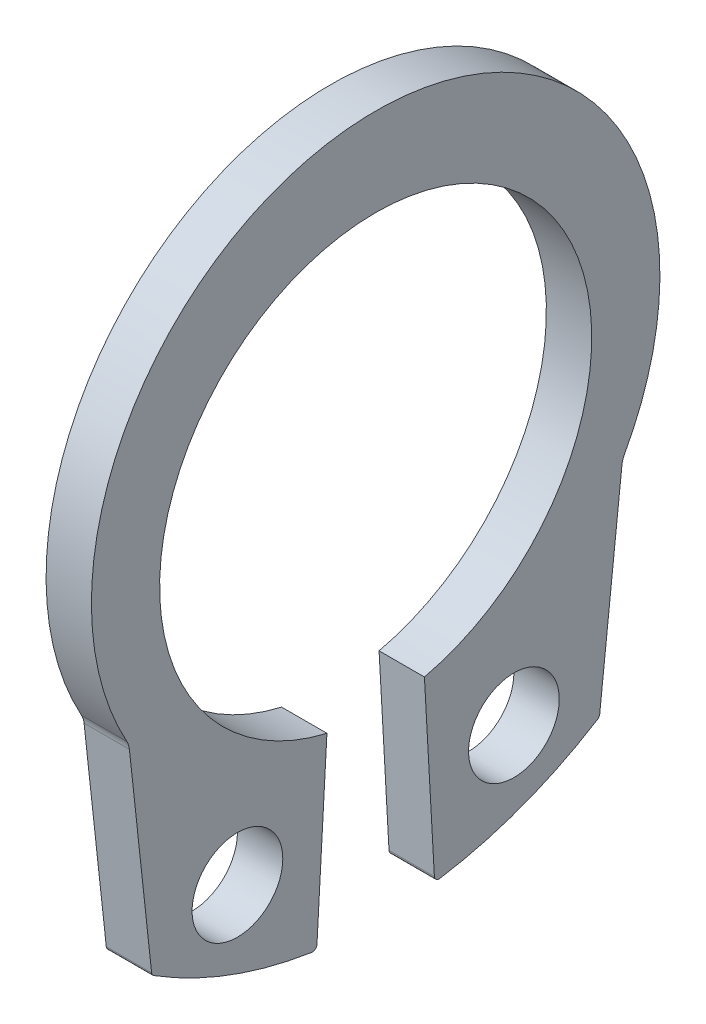
ISO-10303-21;
HEADER;
FILE_DESCRIPTION(('STEP AP214'),'2;1');
FILE_NAME('part.step','',(''),(''),'','','');
FILE_SCHEMA(('AUTOMOTIVE_DESIGN { 1 0 10303 214 1 1 1 1 }'));
ENDSEC;
DATA;
#1=APPLICATION_CONTEXT('core data for automotive mechanical design processes');
#2=APPLICATION_PROTOCOL_DEFINITION('international standard','automotive_design',2000,#1);
#3=PRODUCT_CONTEXT('',#1,'mechanical');
#4=PRODUCT('Part','Part','',(#3));
#5=PRODUCT_RELATED_PRODUCT_CATEGORY('part','',(#4));
#6=PRODUCT_DEFINITION_FORMATION('','',#4);
#7=PRODUCT_DEFINITION_CONTEXT('part definition',#1,'design');
#8=PRODUCT_DEFINITION('design','',#6,#7);
#9=PRODUCT_DEFINITION_SHAPE('','',#8);
#10=(LENGTH_UNIT() NAMED_UNIT(*) SI_UNIT(.MILLI.,.METRE.));
#11=(NAMED_UNIT(*) PLANE_ANGLE_UNIT() SI_UNIT($,.RADIAN.));
#12=(NAMED_UNIT(*) SI_UNIT($,.STERADIAN.) SOLID_ANGLE_UNIT());
#13=UNCERTAINTY_MEASURE_WITH_UNIT(LENGTH_MEASURE(1.E-05),#10,'distance_accuracy_value','');
#14=(GEOMETRIC_REPRESENTATION_CONTEXT(3) GLOBAL_UNCERTAINTY_ASSIGNED_CONTEXT((#13)) GLOBAL_UNIT_ASSIGNED_CONTEXT((#10,
#11,#12)) REPRESENTATION_CONTEXT('',''));
#15=CARTESIAN_POINT('',(0.,0.,0.));
#16=DIRECTION('',(0.,0.,1.));
#17=DIRECTION('',(1.,0.,0.));
#18=AXIS2_PLACEMENT_3D('',#15,#16,#17);
#19=CARTESIAN_POINT('',(0.85,-2.39792397685185,-5.01373537734668));
#20=DIRECTION('',(-1.,0.,0.));
#21=DIRECTION('',(0.,0.,1.));
#22=AXIS2_PLACEMENT_3D('',#19,#20,#21);
#23=CYLINDRICAL_SURFACE('',#22,0.4);
#24=CARTESIAN_POINT('',(0.85,-2.39792397685185,-5.01373537734668));
#25=DIRECTION('',(-1.,0.,0.));
#26=DIRECTION('',(0.,0.,-1.));
#27=AXIS2_PLACEMENT_3D('',#24,#25,#26);
#28=CIRCLE('',#27,0.4);
#29=CARTESIAN_POINT('',(0.85,-2.3547374993622,-4.61607355096397));
#30=VERTEX_POINT('',#29);
#31=CARTESIAN_POINT('',(0.85,-2.20449375873755,-4.6636143258227));
#32=VERTEX_POINT('',#31);
#33=EDGE_CURVE('E37',#30,#32,#28,.T.);
#34=ORIENTED_EDGE('',*,*,#33,.F.);
#35=DIRECTION('',(1.,0.,0.));
#36=VECTOR('',#35,1.);
#37=CARTESIAN_POINT('',(0.85,-2.3547374993622,-4.61607355096397));
#38=LINE('',#37,#36);
#39=CARTESIAN_POINT('',(0.,-2.3547374993622,-4.61607355096397));
#40=VERTEX_POINT('',#39);
#41=EDGE_CURVE('E212',#40,#30,#38,.T.);
#42=ORIENTED_EDGE('',*,*,#41,.F.);
#43=CARTESIAN_POINT('',(0.,-2.39792397685185,-5.01373537734668));
#44=DIRECTION('',(1.,0.,0.));
#45=DIRECTION('',(0.,0.,-1.));
#46=AXIS2_PLACEMENT_3D('',#43,#44,#45);
#47=CIRCLE('',#46,0.4);
#48=CARTESIAN_POINT('',(0.,-2.20449375873755,-4.6636143258227));
#49=VERTEX_POINT('',#48);
#50=EDGE_CURVE('E11',#49,#40,#47,.T.);
#51=ORIENTED_EDGE('',*,*,#50,.F.);
#52=DIRECTION('',(-1.,0.,0.));
#53=VECTOR('',#52,1.);
#54=CARTESIAN_POINT('',(0.85,-2.20449375873755,-4.6636143258227));
#55=LINE('',#54,#53);
#56=EDGE_CURVE('E309',#32,#49,#55,.T.);
#57=ORIENTED_EDGE('',*,*,#56,.F.);
#58=EDGE_LOOP('',(#34,#42,#51,#57));
#59=FACE_BOUND('',#58,.T.);
#60=ADVANCED_FACE('F17',(#59),#23,.F.);
#61=CARTESIAN_POINT('',(0.85,-2.39792397685184,5.01373537734669));
#62=DIRECTION('',(-1.,0.,0.));
#63=DIRECTION('',(0.,0.,1.));
#64=AXIS2_PLACEMENT_3D('',#61,#62,#63);
#65=CYLINDRICAL_SURFACE('',#64,0.4);
#66=CARTESIAN_POINT('',(0.85,-2.39792397685184,5.01373537734669));
#67=DIRECTION('',(-1.,0.,0.));
#68=DIRECTION('',(0.,0.,-1.));
#69=AXIS2_PLACEMENT_3D('',#66,#67,#68);
#70=CIRCLE('',#69,0.4);
#71=CARTESIAN_POINT('',(0.85,-2.20449375873754,4.66361432582271));
#72=VERTEX_POINT('',#71);
#73=CARTESIAN_POINT('',(0.85,-2.35473749936219,4.61607355096397));
#74=VERTEX_POINT('',#73);
#75=EDGE_CURVE('E220',#72,#74,#70,.T.);
#76=ORIENTED_EDGE('',*,*,#75,.F.);
#77=DIRECTION('',(1.,0.,0.));
#78=VECTOR('',#77,1.);
#79=CARTESIAN_POINT('',(0.85,-2.20449375873754,4.66361432582271));
#80=LINE('',#79,#78);
#81=CARTESIAN_POINT('',(0.,-2.20449375873754,4.66361432582271));
#82=VERTEX_POINT('',#81);
#83=EDGE_CURVE('E299',#82,#72,#80,.T.);
#84=ORIENTED_EDGE('',*,*,#83,.F.);
#85=CARTESIAN_POINT('',(0.,-2.39792397685184,5.01373537734669));
#86=DIRECTION('',(1.,0.,0.));
#87=DIRECTION('',(0.,0.,-1.));
#88=AXIS2_PLACEMENT_3D('',#85,#86,#87);
#89=CIRCLE('',#88,0.4);
#90=CARTESIAN_POINT('',(0.,-2.35473749936219,4.61607355096397));
#91=VERTEX_POINT('',#90);
#92=EDGE_CURVE('E25',#91,#82,#89,.T.);
#93=ORIENTED_EDGE('',*,*,#92,.F.);
#94=DIRECTION('',(-1.,0.,0.));
#95=VECTOR('',#94,1.);
#96=CARTESIAN_POINT('',(0.85,-2.35473749936219,4.61607355096397));
#97=LINE('',#96,#95);
#98=EDGE_CURVE('E236',#74,#91,#97,.T.);
#99=ORIENTED_EDGE('',*,*,#98,.F.);
#100=EDGE_LOOP('',(#76,#84,#93,#99));
#101=FACE_BOUND('',#100,.T.);
#102=ADVANCED_FACE('F366',(#101),#65,.F.);
#103=CARTESIAN_POINT('',(0.,0.,0.));
#104=DIRECTION('',(1.,0.,0.));
#105=DIRECTION('',(0.,1.,0.));
#106=AXIS2_PLACEMENT_3D('',#103,#104,#105);
#107=PLANE('',#106);
#108=CARTESIAN_POINT('',(0.,-5.56782224250959,2.59106511830008));
#109=DIRECTION('',(1.,0.,0.));
#110=DIRECTION('',(0.,0.,-1.));
#111=AXIS2_PLACEMENT_3D('',#108,#109,#110);
#112=CIRCLE('',#111,0.85);
#113=CARTESIAN_POINT('',(0.,-5.56782224250959,1.74106511830008));
#114=VERTEX_POINT('',#113);
#115=EDGE_CURVE('E317',#114,#114,#112,.T.);
#116=ORIENTED_EDGE('',*,*,#115,.T.);
#117=EDGE_LOOP('',(#116));
#118=FACE_BOUND('',#117,.T.);
#119=CARTESIAN_POINT('',(0.,-5.56782224250959,-2.59106511830008));
#120=DIRECTION('',(-1.,0.,0.));
#121=DIRECTION('',(0.,0.,-1.));
#122=AXIS2_PLACEMENT_3D('',#119,#120,#121);
#123=CIRCLE('',#122,0.85);
#124=CARTESIAN_POINT('',(0.,-5.56782224250959,-3.44106511830008));
#125=VERTEX_POINT('',#124);
#126=EDGE_CURVE('E333',#125,#125,#123,.T.);
#127=ORIENTED_EDGE('',*,*,#126,.F.);
#128=EDGE_LOOP('',(#127));
#129=FACE_BOUND('',#128,.T.);
#130=DIRECTION('',(0.,0.994154565956785,0.107966193724127));
#131=VECTOR('',#130,1.);
#132=CARTESIAN_POINT('',(0.,-0.522915110689556,4.81501131945199));
#133=LINE('',#132,#131);
#134=CARTESIAN_POINT('',(0.,-6.19075573329271,4.19947808185275));
#135=VERTEX_POINT('',#134);
#136=EDGE_CURVE('E240',#135,#91,#133,.T.);
#137=ORIENTED_EDGE('',*,*,#136,.T.);
#138=ORIENTED_EDGE('',*,*,#92,.T.);
#139=CARTESIAN_POINT('',(0.,0.371997807017542,0.));
#140=DIRECTION('',(1.,0.,0.));
#141=DIRECTION('',(0.,0.,-1.));
#142=AXIS2_PLACEMENT_3D('',#139,#140,#141);
#143=CIRCLE('',#142,5.32800219298246);
#144=EDGE_CURVE('E304',#49,#82,#143,.T.);
#145=ORIENTED_EDGE('',*,*,#144,.F.);
#146=ORIENTED_EDGE('',*,*,#50,.T.);
#147=DIRECTION('',(0.,0.994154565956785,-0.107966193724126));
#148=VECTOR('',#147,1.);
#149=CARTESIAN_POINT('',(0.,-0.522915110689551,-4.81501131945199));
#150=LINE('',#149,#148);
#151=CARTESIAN_POINT('',(0.,-6.19075573329271,-4.19947808185275));
#152=VERTEX_POINT('',#151);
#153=EDGE_CURVE('E208',#152,#40,#150,.T.);
#154=ORIENTED_EDGE('',*,*,#153,.F.);
#155=CARTESIAN_POINT('',(0.,-6.1811158134206,-4.11071353412026));
#156=DIRECTION('',(-1.,0.,0.));
#157=DIRECTION('',(0.,0.,-1.));
#158=AXIS2_PLACEMENT_3D('',#155,#156,#157);
#159=CIRCLE('',#158,0.0892864658797376);
#160=CARTESIAN_POINT('',(0.,-6.25675257958271,-4.15815984687302));
#161=VERTEX_POINT('',#160);
#162=EDGE_CURVE('E200',#152,#161,#159,.T.);
#163=ORIENTED_EDGE('',*,*,#162,.T.);
#164=CARTESIAN_POINT('',(0.,0.371997807017542,0.));
#165=DIRECTION('',(1.,0.,0.));
#166=DIRECTION('',(0.,0.,-1.));
#167=AXIS2_PLACEMENT_3D('',#164,#165,#166);
#168=CIRCLE('',#167,7.825);
#169=CARTESIAN_POINT('',(0.,-7.35997373313335,-1.20301334252644));
#170=VERTEX_POINT('',#169);
#171=EDGE_CURVE('E157',#170,#161,#168,.T.);
#172=ORIENTED_EDGE('',*,*,#171,.F.);
#173=CARTESIAN_POINT('',(0.,-7.27174876021286,-1.18928646587975));
#174=DIRECTION('',(-1.,0.,0.));
#175=DIRECTION('',(0.,0.,-1.));
#176=AXIS2_PLACEMENT_3D('',#173,#174,#175);
#177=CIRCLE('',#176,0.0892864658797398);
#178=CARTESIAN_POINT('',(0.,-7.27674135002132,-1.1001396934407));
#179=VERTEX_POINT('',#178);
#180=EDGE_CURVE('E148',#170,#179,#177,.T.);
#181=ORIENTED_EDGE('',*,*,#180,.T.);
#182=DIRECTION('',(0.,0.998435446634371,0.0559165351575345));
#183=VECTOR('',#182,1.);
#184=CARTESIAN_POINT('',(0.,0.0386678666475541,-0.690446369716576));
#185=LINE('',#184,#183);
#186=CARTESIAN_POINT('',(0.,-3.94561359779142,-0.913582692985955));
#187=VERTEX_POINT('',#186);
#188=EDGE_CURVE('E154',#179,#187,#185,.T.);
#189=ORIENTED_EDGE('',*,*,#188,.T.);
#190=CARTESIAN_POINT('',(0.,0.,0.));
#191=DIRECTION('',(1.,0.,0.));
#192=DIRECTION('',(0.,0.,-1.));
#193=AXIS2_PLACEMENT_3D('',#190,#191,#192);
#194=CIRCLE('',#193,4.05);
#195=CARTESIAN_POINT('',(0.,-3.94561359779142,0.913582692985955));
#196=VERTEX_POINT('',#195);
#197=EDGE_CURVE('E248',#187,#196,#194,.T.);
#198=ORIENTED_EDGE('',*,*,#197,.T.);
#199=DIRECTION('',(0.,0.998435446634371,-0.0559165351575343));
#200=VECTOR('',#199,1.);
#201=CARTESIAN_POINT('',(0.,0.0386678666475539,0.690446369716574));
#202=LINE('',#201,#200);
#203=CARTESIAN_POINT('',(0.,-7.27674135002132,1.1001396934407));
#204=VERTEX_POINT('',#203);
#205=EDGE_CURVE('E185',#204,#196,#202,.T.);
#206=ORIENTED_EDGE('',*,*,#205,.F.);
#207=CARTESIAN_POINT('',(0.,-7.27174876021286,1.18928646587974));
#208=DIRECTION('',(1.,0.,0.));
#209=DIRECTION('',(0.,0.,-1.));
#210=AXIS2_PLACEMENT_3D('',#207,#208,#209);
#211=CIRCLE('',#210,0.0892864658797448);
#212=CARTESIAN_POINT('',(0.,-7.35997373313335,1.20301334252644));
#213=VERTEX_POINT('',#212);
#214=EDGE_CURVE('E274',#213,#204,#211,.T.);
#215=ORIENTED_EDGE('',*,*,#214,.F.);
#216=CARTESIAN_POINT('',(0.,0.371997807017542,0.));
#217=DIRECTION('',(1.,0.,0.));
#218=DIRECTION('',(0.,0.,-1.));
#219=AXIS2_PLACEMENT_3D('',#216,#217,#218);
#220=CIRCLE('',#219,7.825);
#221=CARTESIAN_POINT('',(0.,-6.25675257958271,4.15815984687302));
#222=VERTEX_POINT('',#221);
#223=EDGE_CURVE('E265',#222,#213,#220,.T.);
#224=ORIENTED_EDGE('',*,*,#223,.F.);
#225=CARTESIAN_POINT('',(0.,-6.1811158134206,4.11071353412026));
#226=DIRECTION('',(1.,0.,0.));
#227=DIRECTION('',(0.,0.,-1.));
#228=AXIS2_PLACEMENT_3D('',#225,#226,#227);
#229=CIRCLE('',#228,0.0892864658797463);
#230=EDGE_CURVE('E253',#135,#222,#229,.T.);
#231=ORIENTED_EDGE('',*,*,#230,.F.);
#232=EDGE_LOOP('',(#137,#138,#145,#146,#154,#163,#172,#181,#189,#198,#206,#215,#224,#231));
#233=FACE_BOUND('',#232,.T.);
#234=ADVANCED_FACE('F151',(#118,#129,#233),#107,.F.);
#235=CARTESIAN_POINT('',(0.85,0.,0.));
#236=DIRECTION('',(1.,0.,0.));
#237=DIRECTION('',(0.,1.,0.));
#238=AXIS2_PLACEMENT_3D('',#235,#236,#237);
#239=PLANE('',#238);
#240=CARTESIAN_POINT('',(0.85,-5.56782224250959,2.59106511830008));
#241=DIRECTION('',(1.,0.,0.));
#242=DIRECTION('',(0.,0.,-1.));
#243=AXIS2_PLACEMENT_3D('',#240,#241,#242);
#244=CIRCLE('',#243,0.85);
#245=CARTESIAN_POINT('',(0.85,-5.56782224250959,1.74106511830008));
#246=VERTEX_POINT('',#245);
#247=EDGE_CURVE('E329',#246,#246,#244,.T.);
#248=ORIENTED_EDGE('',*,*,#247,.F.);
#249=EDGE_LOOP('',(#248));
#250=FACE_BOUND('',#249,.T.);
#251=CARTESIAN_POINT('',(0.85,-5.56782224250959,-2.59106511830008));
#252=DIRECTION('',(-1.,0.,0.));
#253=DIRECTION('',(0.,0.,-1.));
#254=AXIS2_PLACEMENT_3D('',#251,#252,#253);
#255=CIRCLE('',#254,0.85);
#256=CARTESIAN_POINT('',(0.85,-5.56782224250959,-3.44106511830008));
#257=VERTEX_POINT('',#256);
#258=EDGE_CURVE('E340',#257,#257,#255,.T.);
#259=ORIENTED_EDGE('',*,*,#258,.T.);
#260=EDGE_LOOP('',(#259));
#261=FACE_BOUND('',#260,.T.);
#262=DIRECTION('',(0.,0.994154565956785,0.107966193724127));
#263=VECTOR('',#262,1.);
#264=CARTESIAN_POINT('',(0.85,-0.522915110689556,4.81501131945199));
#265=LINE('',#264,#263);
#266=CARTESIAN_POINT('',(0.85,-6.19075573329271,4.19947808185275));
#267=VERTEX_POINT('',#266);
#268=EDGE_CURVE('E241',#267,#74,#265,.T.);
#269=ORIENTED_EDGE('',*,*,#268,.F.);
#270=CARTESIAN_POINT('',(0.85,-6.1811158134206,4.11071353412026));
#271=DIRECTION('',(1.,0.,0.));
#272=DIRECTION('',(0.,0.,-1.));
#273=AXIS2_PLACEMENT_3D('',#270,#271,#272);
#274=CIRCLE('',#273,0.0892864658797463);
#275=CARTESIAN_POINT('',(0.85,-6.25675257958271,4.15815984687302));
#276=VERTEX_POINT('',#275);
#277=EDGE_CURVE('E261',#267,#276,#274,.T.);
#278=ORIENTED_EDGE('',*,*,#277,.T.);
#279=CARTESIAN_POINT('',(0.85,0.371997807017542,0.));
#280=DIRECTION('',(1.,0.,0.));
#281=DIRECTION('',(0.,0.,-1.));
#282=AXIS2_PLACEMENT_3D('',#279,#280,#281);
#283=CIRCLE('',#282,7.825);
#284=CARTESIAN_POINT('',(0.85,-7.35997373313335,1.20301334252644));
#285=VERTEX_POINT('',#284);
#286=EDGE_CURVE('E270',#276,#285,#283,.T.);
#287=ORIENTED_EDGE('',*,*,#286,.T.);
#288=CARTESIAN_POINT('',(0.85,-7.27174876021286,1.18928646587974));
#289=DIRECTION('',(1.,0.,0.));
#290=DIRECTION('',(0.,0.,-1.));
#291=AXIS2_PLACEMENT_3D('',#288,#289,#290);
#292=CIRCLE('',#291,0.0892864658797448);
#293=CARTESIAN_POINT('',(0.85,-7.27674135002132,1.1001396934407));
#294=VERTEX_POINT('',#293);
#295=EDGE_CURVE('E282',#285,#294,#292,.T.);
#296=ORIENTED_EDGE('',*,*,#295,.T.);
#297=DIRECTION('',(0.,0.998435446634371,-0.0559165351575343));
#298=VECTOR('',#297,1.);
#299=CARTESIAN_POINT('',(0.85,0.0386678666475539,0.690446369716574));
#300=LINE('',#299,#298);
#301=CARTESIAN_POINT('',(0.85,-3.94561359779142,0.913582692985955));
#302=VERTEX_POINT('',#301);
#303=EDGE_CURVE('E179',#294,#302,#300,.T.);
#304=ORIENTED_EDGE('',*,*,#303,.T.);
#305=CARTESIAN_POINT('',(0.85,0.,0.));
#306=DIRECTION('',(1.,0.,0.));
#307=DIRECTION('',(0.,0.,-1.));
#308=AXIS2_PLACEMENT_3D('',#305,#306,#307);
#309=CIRCLE('',#308,4.05);
#310=CARTESIAN_POINT('',(0.85,-3.94561359779142,-0.913582692985955));
#311=VERTEX_POINT('',#310);
#312=EDGE_CURVE('E249',#311,#302,#309,.T.);
#313=ORIENTED_EDGE('',*,*,#312,.F.);
#314=DIRECTION('',(0.,0.998435446634371,0.0559165351575345));
#315=VECTOR('',#314,1.);
#316=CARTESIAN_POINT('',(0.85,0.0386678666475541,-0.690446369716576));
#317=LINE('',#316,#315);
#318=CARTESIAN_POINT('',(0.85,-7.27674135002132,-1.1001396934407));
#319=VERTEX_POINT('',#318);
#320=EDGE_CURVE('E163',#319,#311,#317,.T.);
#321=ORIENTED_EDGE('',*,*,#320,.F.);
#322=CARTESIAN_POINT('',(0.85,-7.27174876021286,-1.18928646587975));
#323=DIRECTION('',(-1.,0.,0.));
#324=DIRECTION('',(0.,0.,-1.));
#325=AXIS2_PLACEMENT_3D('',#322,#323,#324);
#326=CIRCLE('',#325,0.0892864658797398);
#327=CARTESIAN_POINT('',(0.85,-7.35997373313335,-1.20301334252644));
#328=VERTEX_POINT('',#327);
#329=EDGE_CURVE('E169',#328,#319,#326,.T.);
#330=ORIENTED_EDGE('',*,*,#329,.F.);
#331=CARTESIAN_POINT('',(0.85,0.371997807017542,0.));
#332=DIRECTION('',(1.,0.,0.));
#333=DIRECTION('',(0.,0.,-1.));
#334=AXIS2_PLACEMENT_3D('',#331,#332,#333);
#335=CIRCLE('',#334,7.825);
#336=CARTESIAN_POINT('',(0.85,-6.25675257958271,-4.15815984687302));
#337=VERTEX_POINT('',#336);
#338=EDGE_CURVE('E196',#328,#337,#335,.T.);
#339=ORIENTED_EDGE('',*,*,#338,.T.);
#340=CARTESIAN_POINT('',(0.85,-6.1811158134206,-4.11071353412026));
#341=DIRECTION('',(-1.,0.,0.));
#342=DIRECTION('',(0.,0.,-1.));
#343=AXIS2_PLACEMENT_3D('',#340,#341,#342);
#344=CIRCLE('',#343,0.0892864658797376);
#345=CARTESIAN_POINT('',(0.85,-6.19075573329271,-4.19947808185275));
#346=VERTEX_POINT('',#345);
#347=EDGE_CURVE('E207',#346,#337,#344,.T.);
#348=ORIENTED_EDGE('',*,*,#347,.F.);
#349=DIRECTION('',(0.,0.994154565956785,-0.107966193724126));
#350=VECTOR('',#349,1.);
#351=CARTESIAN_POINT('',(0.85,-0.522915110689551,-4.81501131945199));
#352=LINE('',#351,#350);
#353=EDGE_CURVE('E216',#346,#30,#352,.T.);
#354=ORIENTED_EDGE('',*,*,#353,.T.);
#355=ORIENTED_EDGE('',*,*,#33,.T.);
#356=CARTESIAN_POINT('',(0.85,0.371997807017542,0.));
#357=DIRECTION('',(1.,0.,0.));
#358=DIRECTION('',(0.,0.,-1.));
#359=AXIS2_PLACEMENT_3D('',#356,#357,#358);
#360=CIRCLE('',#359,5.32800219298246);
#361=EDGE_CURVE('E314',#32,#72,#360,.T.);
#362=ORIENTED_EDGE('',*,*,#361,.T.);
#363=ORIENTED_EDGE('',*,*,#75,.T.);
#364=EDGE_LOOP('',(#269,#278,#287,#296,#304,#313,#321,#330,#339,#348,#354,#355,#362,#363));
#365=FACE_BOUND('',#364,.T.);
#366=ADVANCED_FACE('F350',(#250,#261,#365),#239,.T.);
#367=CARTESIAN_POINT('',(0.85,-0.522915110689551,-4.81501131945199));
#368=DIRECTION('',(0.,0.107966193724126,0.994154565956785));
#369=DIRECTION('',(1.,0.,0.));
#370=AXIS2_PLACEMENT_3D('',#367,#368,#369);
#371=PLANE('',#370);
#372=ORIENTED_EDGE('',*,*,#153,.T.);
#373=ORIENTED_EDGE('',*,*,#41,.T.);
#374=ORIENTED_EDGE('',*,*,#353,.F.);
#375=DIRECTION('',(-1.,0.,0.));
#376=VECTOR('',#375,1.);
#377=CARTESIAN_POINT('',(0.85,-6.19075573329271,-4.19947808185275));
#378=LINE('',#377,#376);
#379=EDGE_CURVE('E203',#346,#152,#378,.T.);
#380=ORIENTED_EDGE('',*,*,#379,.T.);
#381=EDGE_LOOP('',(#372,#373,#374,#380));
#382=FACE_BOUND('',#381,.T.);
#383=ADVANCED_FACE('F391',(#382),#371,.F.);
#384=CARTESIAN_POINT('',(0.85,-6.1811158134206,-4.11071353412026));
#385=DIRECTION('',(-1.,0.,0.));
#386=DIRECTION('',(0.,0.,1.));
#387=AXIS2_PLACEMENT_3D('',#384,#385,#386);
#388=CYLINDRICAL_SURFACE('',#387,0.0892864658797376);
#389=ORIENTED_EDGE('',*,*,#162,.F.);
#390=ORIENTED_EDGE('',*,*,#379,.F.);
#391=ORIENTED_EDGE('',*,*,#347,.T.);
#392=DIRECTION('',(-1.,0.,0.));
#393=VECTOR('',#392,1.);
#394=CARTESIAN_POINT('',(0.85,-6.25675257958271,-4.15815984687302));
#395=LINE('',#394,#393);
#396=EDGE_CURVE('E195',#337,#161,#395,.T.);
#397=ORIENTED_EDGE('',*,*,#396,.T.);
#398=EDGE_LOOP('',(#389,#390,#391,#397));
#399=FACE_BOUND('',#398,.T.);
#400=ADVANCED_FACE('F393',(#399),#388,.T.);
#401=CARTESIAN_POINT('',(0.85,0.371997807017542,0.));
#402=DIRECTION('',(-1.,0.,0.));
#403=DIRECTION('',(0.,0.,1.));
#404=AXIS2_PLACEMENT_3D('',#401,#402,#403);
#405=CYLINDRICAL_SURFACE('',#404,7.825);
#406=ORIENTED_EDGE('',*,*,#171,.T.);
#407=ORIENTED_EDGE('',*,*,#396,.F.);
#408=ORIENTED_EDGE('',*,*,#338,.F.);
#409=DIRECTION('',(-1.,0.,0.));
#410=VECTOR('',#409,1.);
#411=CARTESIAN_POINT('',(0.85,-7.35997373313335,-1.20301334252644));
#412=LINE('',#411,#410);
#413=EDGE_CURVE('E162',#328,#170,#412,.T.);
#414=ORIENTED_EDGE('',*,*,#413,.T.);
#415=EDGE_LOOP('',(#406,#407,#408,#414));
#416=FACE_BOUND('',#415,.T.);
#417=ADVANCED_FACE('F396',(#416),#405,.T.);
#418=CARTESIAN_POINT('',(0.85,-7.27174876021286,-1.18928646587975));
#419=DIRECTION('',(-1.,0.,0.));
#420=DIRECTION('',(0.,0.,1.));
#421=AXIS2_PLACEMENT_3D('',#418,#419,#420);
#422=CYLINDRICAL_SURFACE('',#421,0.0892864658797398);
#423=ORIENTED_EDGE('',*,*,#180,.F.);
#424=ORIENTED_EDGE('',*,*,#413,.F.);
#425=ORIENTED_EDGE('',*,*,#329,.T.);
#426=DIRECTION('',(-1.,0.,0.));
#427=VECTOR('',#426,1.);
#428=CARTESIAN_POINT('',(0.85,-7.27674135002132,-1.1001396934407));
#429=LINE('',#428,#427);
#430=EDGE_CURVE('E166',#319,#179,#429,.T.);
#431=ORIENTED_EDGE('',*,*,#430,.T.);
#432=EDGE_LOOP('',(#423,#424,#425,#431));
#433=FACE_BOUND('',#432,.T.);
#434=ADVANCED_FACE('F167',(#433),#422,.T.);
#435=CARTESIAN_POINT('',(0.85,0.0386678666475541,-0.690446369716576));
#436=DIRECTION('',(0.,-0.0559165351575345,0.998435446634371));
#437=DIRECTION('',(-1.,0.,0.));
#438=AXIS2_PLACEMENT_3D('',#435,#436,#437);
#439=PLANE('',#438);
#440=ORIENTED_EDGE('',*,*,#188,.F.);
#441=ORIENTED_EDGE('',*,*,#430,.F.);
#442=ORIENTED_EDGE('',*,*,#320,.T.);
#443=DIRECTION('',(-1.,0.,0.));
#444=VECTOR('',#443,1.);
#445=CARTESIAN_POINT('',(0.85,-3.94561359779142,-0.913582692985955));
#446=LINE('',#445,#444);
#447=EDGE_CURVE('E176',#311,#187,#446,.T.);
#448=ORIENTED_EDGE('',*,*,#447,.T.);
#449=EDGE_LOOP('',(#440,#441,#442,#448));
#450=FACE_BOUND('',#449,.T.);
#451=ADVANCED_FACE('F174',(#450),#439,.T.);
#452=CARTESIAN_POINT('',(0.85,0.0386678666475539,0.690446369716574));
#453=DIRECTION('',(0.,0.0559165351575343,0.998435446634371));
#454=DIRECTION('',(1.,0.,0.));
#455=AXIS2_PLACEMENT_3D('',#452,#453,#454);
#456=PLANE('',#455);
#457=ORIENTED_EDGE('',*,*,#205,.T.);
#458=DIRECTION('',(-1.,0.,0.));
#459=VECTOR('',#458,1.);
#460=CARTESIAN_POINT('',(0.85,-3.94561359779142,0.913582692985955));
#461=LINE('',#460,#459);
#462=EDGE_CURVE('E244',#302,#196,#461,.T.);
#463=ORIENTED_EDGE('',*,*,#462,.F.);
#464=ORIENTED_EDGE('',*,*,#303,.F.);
#465=DIRECTION('',(-1.,0.,0.));
#466=VECTOR('',#465,1.);
#467=CARTESIAN_POINT('',(0.85,-7.27674135002132,1.1001396934407));
#468=LINE('',#467,#466);
#469=EDGE_CURVE('E278',#294,#204,#468,.T.);
#470=ORIENTED_EDGE('',*,*,#469,.T.);
#471=EDGE_LOOP('',(#457,#463,#464,#470));
#472=FACE_BOUND('',#471,.T.);
#473=ADVANCED_FACE('F290',(#472),#456,.F.);
#474=CARTESIAN_POINT('',(0.85,-7.27174876021286,1.18928646587974));
#475=DIRECTION('',(-1.,0.,0.));
#476=DIRECTION('',(0.,0.,1.));
#477=AXIS2_PLACEMENT_3D('',#474,#475,#476);
#478=CYLINDRICAL_SURFACE('',#477,0.0892864658797448);
#479=ORIENTED_EDGE('',*,*,#214,.T.);
#480=ORIENTED_EDGE('',*,*,#469,.F.);
#481=ORIENTED_EDGE('',*,*,#295,.F.);
#482=DIRECTION('',(-1.,0.,0.));
#483=VECTOR('',#482,1.);
#484=CARTESIAN_POINT('',(0.85,-7.35997373313335,1.20301334252644));
#485=LINE('',#484,#483);
#486=EDGE_CURVE('E269',#285,#213,#485,.T.);
#487=ORIENTED_EDGE('',*,*,#486,.T.);
#488=EDGE_LOOP('',(#479,#480,#481,#487));
#489=FACE_BOUND('',#488,.T.);
#490=ADVANCED_FACE('F384',(#489),#478,.T.);
#491=CARTESIAN_POINT('',(0.85,0.371997807017542,0.));
#492=DIRECTION('',(-1.,0.,0.));
#493=DIRECTION('',(0.,0.,1.));
#494=AXIS2_PLACEMENT_3D('',#491,#492,#493);
#495=CYLINDRICAL_SURFACE('',#494,7.825);
#496=ORIENTED_EDGE('',*,*,#223,.T.);
#497=ORIENTED_EDGE('',*,*,#486,.F.);
#498=ORIENTED_EDGE('',*,*,#286,.F.);
#499=DIRECTION('',(-1.,0.,0.));
#500=VECTOR('',#499,1.);
#501=CARTESIAN_POINT('',(0.85,-6.25675257958271,4.15815984687302));
#502=LINE('',#501,#500);
#503=EDGE_CURVE('E257',#276,#222,#502,.T.);
#504=ORIENTED_EDGE('',*,*,#503,.T.);
#505=EDGE_LOOP('',(#496,#497,#498,#504));
#506=FACE_BOUND('',#505,.T.);
#507=ADVANCED_FACE('F380',(#506),#495,.T.);
#508=CARTESIAN_POINT('',(0.85,-6.1811158134206,4.11071353412026));
#509=DIRECTION('',(-1.,0.,0.));
#510=DIRECTION('',(0.,0.,1.));
#511=AXIS2_PLACEMENT_3D('',#508,#509,#510);
#512=CYLINDRICAL_SURFACE('',#511,0.0892864658797463);
#513=ORIENTED_EDGE('',*,*,#230,.T.);
#514=ORIENTED_EDGE('',*,*,#503,.F.);
#515=ORIENTED_EDGE('',*,*,#277,.F.);
#516=DIRECTION('',(-1.,0.,0.));
#517=VECTOR('',#516,1.);
#518=CARTESIAN_POINT('',(0.85,-6.19075573329271,4.19947808185275));
#519=LINE('',#518,#517);
#520=EDGE_CURVE('E252',#267,#135,#519,.T.);
#521=ORIENTED_EDGE('',*,*,#520,.T.);
#522=EDGE_LOOP('',(#513,#514,#515,#521));
#523=FACE_BOUND('',#522,.T.);
#524=ADVANCED_FACE('F383',(#523),#512,.T.);
#525=CARTESIAN_POINT('',(0.85,-0.522915110689556,4.81501131945199));
#526=DIRECTION('',(0.,-0.107966193724127,0.994154565956785));
#527=DIRECTION('',(-1.,0.,0.));
#528=AXIS2_PLACEMENT_3D('',#525,#526,#527);
#529=PLANE('',#528);
#530=ORIENTED_EDGE('',*,*,#268,.T.);
#531=ORIENTED_EDGE('',*,*,#98,.T.);
#532=ORIENTED_EDGE('',*,*,#136,.F.);
#533=ORIENTED_EDGE('',*,*,#520,.F.);
#534=EDGE_LOOP('',(#530,#531,#532,#533));
#535=FACE_BOUND('',#534,.T.);
#536=ADVANCED_FACE('F378',(#535),#529,.T.);
#537=CARTESIAN_POINT('',(0.85,0.,0.));
#538=DIRECTION('',(-1.,0.,0.));
#539=DIRECTION('',(0.,1.,0.));
#540=AXIS2_PLACEMENT_3D('',#537,#538,#539);
#541=CYLINDRICAL_SURFACE('',#540,4.05);
#542=ORIENTED_EDGE('',*,*,#312,.T.);
#543=ORIENTED_EDGE('',*,*,#462,.T.);
#544=ORIENTED_EDGE('',*,*,#197,.F.);
#545=ORIENTED_EDGE('',*,*,#447,.F.);
#546=EDGE_LOOP('',(#542,#543,#544,#545));
#547=FACE_BOUND('',#546,.T.);
#548=ADVANCED_FACE('F296',(#547),#541,.F.);
#549=CARTESIAN_POINT('',(0.85,0.371997807017542,0.));
#550=DIRECTION('',(-1.,0.,0.));
#551=DIRECTION('',(0.,1.,0.));
#552=AXIS2_PLACEMENT_3D('',#549,#550,#551);
#553=CYLINDRICAL_SURFACE('',#552,5.32800219298246);
#554=ORIENTED_EDGE('',*,*,#361,.F.);
#555=ORIENTED_EDGE('',*,*,#56,.T.);
#556=ORIENTED_EDGE('',*,*,#144,.T.);
#557=ORIENTED_EDGE('',*,*,#83,.T.);
#558=EDGE_LOOP('',(#554,#555,#556,#557));
#559=FACE_BOUND('',#558,.T.);
#560=ADVANCED_FACE('F361',(#559),#553,.T.);
#561=CARTESIAN_POINT('',(0.85,-5.56782224250959,2.59106511830008));
#562=DIRECTION('',(-1.,0.,0.));
#563=DIRECTION('',(0.,0.,1.));
#564=AXIS2_PLACEMENT_3D('',#561,#562,#563);
#565=CYLINDRICAL_SURFACE('',#564,0.85);
#566=ORIENTED_EDGE('',*,*,#115,.F.);
#567=EDGE_LOOP('',(#566));
#568=FACE_BOUND('',#567,.T.);
#569=ORIENTED_EDGE('',*,*,#247,.T.);
#570=EDGE_LOOP('',(#569));
#571=FACE_BOUND('',#570,.T.);
#572=ADVANCED_FACE('F354',(#568,#571),#565,.F.);
#573=CARTESIAN_POINT('',(0.85,-5.56782224250959,-2.59106511830008));
#574=DIRECTION('',(-1.,0.,0.));
#575=DIRECTION('',(0.,0.,1.));
#576=AXIS2_PLACEMENT_3D('',#573,#574,#575);
#577=CYLINDRICAL_SURFACE('',#576,0.85);
#578=ORIENTED_EDGE('',*,*,#126,.T.);
#579=EDGE_LOOP('',(#578));
#580=FACE_BOUND('',#579,.T.);
#581=ORIENTED_EDGE('',*,*,#258,.F.);
#582=EDGE_LOOP('',(#581));
#583=FACE_BOUND('',#582,.T.);
#584=ADVANCED_FACE('F352',(#580,#583),#577,.F.);
#585=CLOSED_SHELL('',(#60,#102,#234,#366,#383,#400,#417,#434,#451,#473,#490,#507,#524,#536,#548,
#560,#572,#584));
#586=MANIFOLD_SOLID_BREP('B1',#585);
#587=ADVANCED_BREP_SHAPE_REPRESENTATION('',(#18,#586),#14);
#588=SHAPE_DEFINITION_REPRESENTATION(#9,#587);
ENDSEC;
END-ISO-10303-21;
